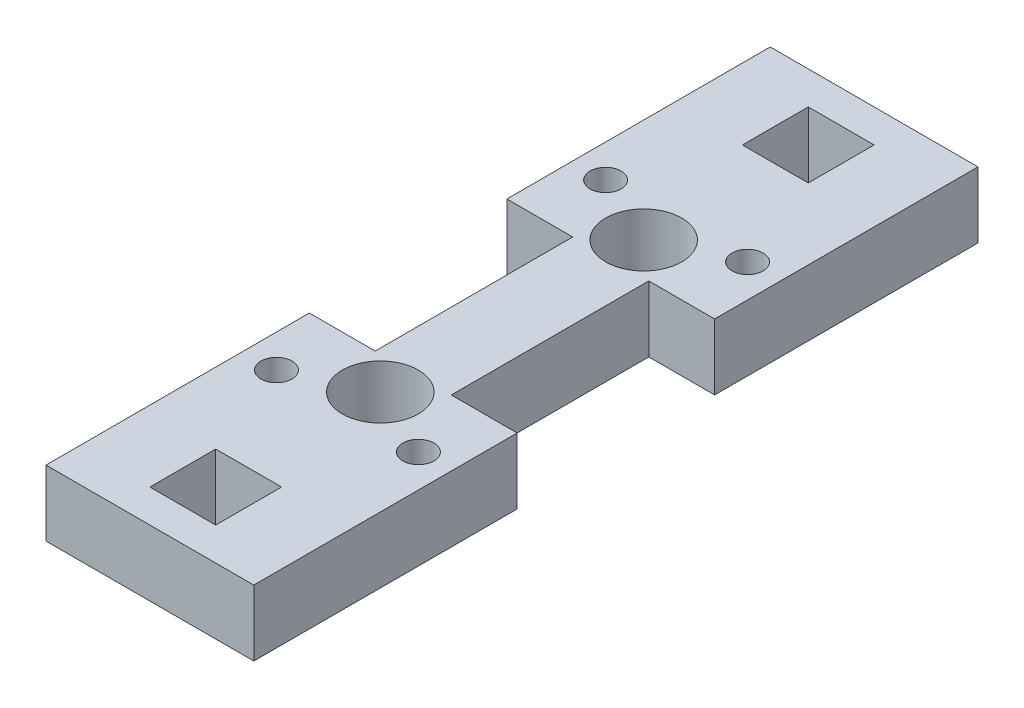
ISO-10303-21;
HEADER;
FILE_DESCRIPTION(('STEP AP214'),'2;1');
FILE_NAME('part.step','',(''),(''),'','','');
FILE_SCHEMA(('AUTOMOTIVE_DESIGN { 1 0 10303 214 1 1 1 1 }'));
ENDSEC;
DATA;
#1=APPLICATION_CONTEXT('core data for automotive mechanical design processes');
#2=APPLICATION_PROTOCOL_DEFINITION('international standard','automotive_design',2000,#1);
#3=PRODUCT_CONTEXT('',#1,'mechanical');
#4=PRODUCT('Part','Part','',(#3));
#5=PRODUCT_RELATED_PRODUCT_CATEGORY('part','',(#4));
#6=PRODUCT_DEFINITION_FORMATION('','',#4);
#7=PRODUCT_DEFINITION_CONTEXT('part definition',#1,'design');
#8=PRODUCT_DEFINITION('design','',#6,#7);
#9=PRODUCT_DEFINITION_SHAPE('','',#8);
#10=(LENGTH_UNIT() NAMED_UNIT(*) SI_UNIT(.MILLI.,.METRE.));
#11=(NAMED_UNIT(*) PLANE_ANGLE_UNIT() SI_UNIT($,.RADIAN.));
#12=(NAMED_UNIT(*) SI_UNIT($,.STERADIAN.) SOLID_ANGLE_UNIT());
#13=UNCERTAINTY_MEASURE_WITH_UNIT(LENGTH_MEASURE(1.E-05),#10,'distance_accuracy_value','');
#14=(GEOMETRIC_REPRESENTATION_CONTEXT(3) GLOBAL_UNCERTAINTY_ASSIGNED_CONTEXT((#13)) GLOBAL_UNIT_ASSIGNED_CONTEXT((#10,
#11,#12)) REPRESENTATION_CONTEXT('',''));
#15=CARTESIAN_POINT('',(0.,0.,0.));
#16=DIRECTION('',(0.,0.,1.));
#17=DIRECTION('',(1.,0.,0.));
#18=AXIS2_PLACEMENT_3D('',#15,#16,#17);
#19=CARTESIAN_POINT('',(0.,6.35,-44.45));
#20=DIRECTION('',(0.,0.,-1.));
#21=DIRECTION('',(-1.,0.,0.));
#22=AXIS2_PLACEMENT_3D('',#19,#20,#21);
#23=PLANE('',#22);
#24=DIRECTION('',(1.,0.,0.));
#25=VECTOR('',#24,1.);
#26=CARTESIAN_POINT('',(0.,0.,-44.45));
#27=LINE('',#26,#25);
#28=CARTESIAN_POINT('',(0.,0.,-44.45));
#29=VERTEX_POINT('',#28);
#30=CARTESIAN_POINT('',(6.35,0.,-44.45));
#31=VERTEX_POINT('',#30);
#32=EDGE_CURVE('E245',#29,#31,#27,.T.);
#33=ORIENTED_EDGE('',*,*,#32,.T.);
#34=DIRECTION('',(0.,-1.,0.));
#35=VECTOR('',#34,1.);
#36=CARTESIAN_POINT('',(6.35,6.35,-44.45));
#37=LINE('',#36,#35);
#38=CARTESIAN_POINT('',(6.35,6.35,-44.45));
#39=VERTEX_POINT('',#38);
#40=EDGE_CURVE('E11',#39,#31,#37,.T.);
#41=ORIENTED_EDGE('',*,*,#40,.F.);
#42=DIRECTION('',(1.,0.,0.));
#43=VECTOR('',#42,1.);
#44=CARTESIAN_POINT('',(0.,6.35,-44.45));
#45=LINE('',#44,#43);
#46=CARTESIAN_POINT('',(0.,6.35,-44.45));
#47=VERTEX_POINT('',#46);
#48=EDGE_CURVE('E553',#47,#39,#45,.T.);
#49=ORIENTED_EDGE('',*,*,#48,.F.);
#50=DIRECTION('',(0.,-1.,0.));
#51=VECTOR('',#50,1.);
#52=CARTESIAN_POINT('',(0.,6.35,-44.45));
#53=LINE('',#52,#51);
#54=EDGE_CURVE('E54',#47,#29,#53,.T.);
#55=ORIENTED_EDGE('',*,*,#54,.T.);
#56=EDGE_LOOP('',(#33,#41,#49,#55));
#57=FACE_BOUND('',#56,.T.);
#58=ADVANCED_FACE('F35',(#57),#23,.F.);
#59=CARTESIAN_POINT('',(6.35000000000002,6.35,0.));
#60=DIRECTION('',(1.,0.,0.));
#61=DIRECTION('',(0.,0.,-1.));
#62=AXIS2_PLACEMENT_3D('',#59,#60,#61);
#63=PLANE('',#62);
#64=DIRECTION('',(0.,0.,1.));
#65=VECTOR('',#64,1.);
#66=CARTESIAN_POINT('',(6.35000000000002,0.,0.));
#67=LINE('',#66,#65);
#68=CARTESIAN_POINT('',(6.35,0.,-25.4));
#69=VERTEX_POINT('',#68);
#70=EDGE_CURVE('E247',#31,#69,#67,.T.);
#71=ORIENTED_EDGE('',*,*,#70,.T.);
#72=DIRECTION('',(0.,-1.,0.));
#73=VECTOR('',#72,1.);
#74=CARTESIAN_POINT('',(6.35,6.35,-25.4));
#75=LINE('',#74,#73);
#76=CARTESIAN_POINT('',(6.35,6.35,-25.4));
#77=VERTEX_POINT('',#76);
#78=EDGE_CURVE('E45',#77,#69,#75,.T.);
#79=ORIENTED_EDGE('',*,*,#78,.F.);
#80=DIRECTION('',(0.,0.,1.));
#81=VECTOR('',#80,1.);
#82=CARTESIAN_POINT('',(6.35000000000002,6.35,0.));
#83=LINE('',#82,#81);
#84=EDGE_CURVE('E511',#39,#77,#83,.T.);
#85=ORIENTED_EDGE('',*,*,#84,.F.);
#86=ORIENTED_EDGE('',*,*,#40,.T.);
#87=EDGE_LOOP('',(#71,#79,#85,#86));
#88=FACE_BOUND('',#87,.T.);
#89=ADVANCED_FACE('F333',(#88),#63,.F.);
#90=CARTESIAN_POINT('',(0.,6.35,-25.4));
#91=DIRECTION('',(0.,0.,-1.));
#92=DIRECTION('',(-1.,0.,0.));
#93=AXIS2_PLACEMENT_3D('',#90,#91,#92);
#94=PLANE('',#93);
#95=DIRECTION('',(1.,0.,0.));
#96=VECTOR('',#95,1.);
#97=CARTESIAN_POINT('',(0.,0.,-25.4));
#98=LINE('',#97,#96);
#99=CARTESIAN_POINT('',(0.,0.,-25.4));
#100=VERTEX_POINT('',#99);
#101=EDGE_CURVE('E250',#100,#69,#98,.T.);
#102=ORIENTED_EDGE('',*,*,#101,.F.);
#103=DIRECTION('',(0.,-1.,0.));
#104=VECTOR('',#103,1.);
#105=CARTESIAN_POINT('',(0.,6.35,-25.4));
#106=LINE('',#105,#104);
#107=CARTESIAN_POINT('',(0.,6.35,-25.4));
#108=VERTEX_POINT('',#107);
#109=EDGE_CURVE('E287',#108,#100,#106,.T.);
#110=ORIENTED_EDGE('',*,*,#109,.F.);
#111=DIRECTION('',(1.,0.,0.));
#112=VECTOR('',#111,1.);
#113=CARTESIAN_POINT('',(0.,6.35,-25.4));
#114=LINE('',#113,#112);
#115=EDGE_CURVE('E509',#108,#77,#114,.T.);
#116=ORIENTED_EDGE('',*,*,#115,.T.);
#117=ORIENTED_EDGE('',*,*,#78,.T.);
#118=EDGE_LOOP('',(#102,#110,#116,#117));
#119=FACE_BOUND('',#118,.T.);
#120=ADVANCED_FACE('F338',(#119),#94,.T.);
#121=CARTESIAN_POINT('',(0.,6.35,0.));
#122=DIRECTION('',(-1.,0.,0.));
#123=DIRECTION('',(0.,0.,1.));
#124=AXIS2_PLACEMENT_3D('',#121,#122,#123);
#125=PLANE('',#124);
#126=DIRECTION('',(0.,0.,-1.));
#127=VECTOR('',#126,1.);
#128=CARTESIAN_POINT('',(0.,0.,0.));
#129=LINE('',#128,#127);
#130=CARTESIAN_POINT('',(0.,0.,0.));
#131=VERTEX_POINT('',#130);
#132=EDGE_CURVE('E253',#131,#100,#129,.T.);
#133=ORIENTED_EDGE('',*,*,#132,.F.);
#134=DIRECTION('',(0.,-1.,0.));
#135=VECTOR('',#134,1.);
#136=CARTESIAN_POINT('',(0.,6.35,0.));
#137=LINE('',#136,#135);
#138=CARTESIAN_POINT('',(0.,6.35,0.));
#139=VERTEX_POINT('',#138);
#140=EDGE_CURVE('E285',#139,#131,#137,.T.);
#141=ORIENTED_EDGE('',*,*,#140,.F.);
#142=DIRECTION('',(0.,0.,-1.));
#143=VECTOR('',#142,1.);
#144=CARTESIAN_POINT('',(0.,6.35,0.));
#145=LINE('',#144,#143);
#146=EDGE_CURVE('E210',#139,#108,#145,.T.);
#147=ORIENTED_EDGE('',*,*,#146,.T.);
#148=ORIENTED_EDGE('',*,*,#109,.T.);
#149=EDGE_LOOP('',(#133,#141,#147,#148));
#150=FACE_BOUND('',#149,.T.);
#151=ADVANCED_FACE('F411',(#150),#125,.T.);
#152=CARTESIAN_POINT('',(0.,6.35,0.));
#153=DIRECTION('',(0.,0.,-1.));
#154=DIRECTION('',(-1.,0.,0.));
#155=AXIS2_PLACEMENT_3D('',#152,#153,#154);
#156=PLANE('',#155);
#157=DIRECTION('',(1.,0.,0.));
#158=VECTOR('',#157,1.);
#159=CARTESIAN_POINT('',(0.,0.,0.));
#160=LINE('',#159,#158);
#161=CARTESIAN_POINT('',(20.0405999999999,0.,0.));
#162=VERTEX_POINT('',#161);
#163=EDGE_CURVE('E256',#131,#162,#160,.T.);
#164=ORIENTED_EDGE('',*,*,#163,.T.);
#165=DIRECTION('',(0.,-1.,0.));
#166=VECTOR('',#165,1.);
#167=CARTESIAN_POINT('',(20.0405999999999,6.35,0.));
#168=LINE('',#167,#166);
#169=CARTESIAN_POINT('',(20.0405999999999,6.35,0.));
#170=VERTEX_POINT('',#169);
#171=EDGE_CURVE('E282',#170,#162,#168,.T.);
#172=ORIENTED_EDGE('',*,*,#171,.F.);
#173=DIRECTION('',(1.,0.,0.));
#174=VECTOR('',#173,1.);
#175=CARTESIAN_POINT('',(0.,6.35,0.));
#176=LINE('',#175,#174);
#177=EDGE_CURVE('E508',#139,#170,#176,.T.);
#178=ORIENTED_EDGE('',*,*,#177,.F.);
#179=ORIENTED_EDGE('',*,*,#140,.T.);
#180=EDGE_LOOP('',(#164,#172,#178,#179));
#181=FACE_BOUND('',#180,.T.);
#182=ADVANCED_FACE('F488',(#181),#156,.F.);
#183=CARTESIAN_POINT('',(20.0405999999999,6.35,0.));
#184=DIRECTION('',(-1.,0.,0.));
#185=DIRECTION('',(0.,0.,1.));
#186=AXIS2_PLACEMENT_3D('',#183,#184,#185);
#187=PLANE('',#186);
#188=DIRECTION('',(0.,0.,-1.));
#189=VECTOR('',#188,1.);
#190=CARTESIAN_POINT('',(20.0405999999999,0.,0.));
#191=LINE('',#190,#189);
#192=CARTESIAN_POINT('',(20.0405999999999,0.,-25.4));
#193=VERTEX_POINT('',#192);
#194=EDGE_CURVE('E259',#162,#193,#191,.T.);
#195=ORIENTED_EDGE('',*,*,#194,.T.);
#196=DIRECTION('',(0.,-1.,0.));
#197=VECTOR('',#196,1.);
#198=CARTESIAN_POINT('',(20.0405999999999,6.35,-25.4));
#199=LINE('',#198,#197);
#200=CARTESIAN_POINT('',(20.0405999999999,6.35,-25.4));
#201=VERTEX_POINT('',#200);
#202=EDGE_CURVE('E280',#201,#193,#199,.T.);
#203=ORIENTED_EDGE('',*,*,#202,.F.);
#204=DIRECTION('',(0.,0.,-1.));
#205=VECTOR('',#204,1.);
#206=CARTESIAN_POINT('',(20.0405999999999,6.35,0.));
#207=LINE('',#206,#205);
#208=EDGE_CURVE('E195',#170,#201,#207,.T.);
#209=ORIENTED_EDGE('',*,*,#208,.F.);
#210=ORIENTED_EDGE('',*,*,#171,.T.);
#211=EDGE_LOOP('',(#195,#203,#209,#210));
#212=FACE_BOUND('',#211,.T.);
#213=ADVANCED_FACE('F476',(#212),#187,.F.);
#214=CARTESIAN_POINT('',(0.,6.35,-25.4));
#215=DIRECTION('',(0.,0.,-1.));
#216=DIRECTION('',(-1.,0.,0.));
#217=AXIS2_PLACEMENT_3D('',#214,#215,#216);
#218=PLANE('',#217);
#219=DIRECTION('',(1.,0.,0.));
#220=VECTOR('',#219,1.);
#221=CARTESIAN_POINT('',(0.,0.,-25.4));
#222=LINE('',#221,#220);
#223=CARTESIAN_POINT('',(13.6905999999999,0.,-25.4));
#224=VERTEX_POINT('',#223);
#225=EDGE_CURVE('E262',#224,#193,#222,.T.);
#226=ORIENTED_EDGE('',*,*,#225,.F.);
#227=DIRECTION('',(0.,-1.,0.));
#228=VECTOR('',#227,1.);
#229=CARTESIAN_POINT('',(13.6905999999999,6.35,-25.4));
#230=LINE('',#229,#228);
#231=CARTESIAN_POINT('',(13.6905999999999,6.35,-25.4));
#232=VERTEX_POINT('',#231);
#233=EDGE_CURVE('E278',#232,#224,#230,.T.);
#234=ORIENTED_EDGE('',*,*,#233,.F.);
#235=DIRECTION('',(1.,0.,0.));
#236=VECTOR('',#235,1.);
#237=CARTESIAN_POINT('',(0.,6.35,-25.4));
#238=LINE('',#237,#236);
#239=EDGE_CURVE('E515',#232,#201,#238,.T.);
#240=ORIENTED_EDGE('',*,*,#239,.T.);
#241=ORIENTED_EDGE('',*,*,#202,.T.);
#242=EDGE_LOOP('',(#226,#234,#240,#241));
#243=FACE_BOUND('',#242,.T.);
#244=ADVANCED_FACE('F483',(#243),#218,.T.);
#245=CARTESIAN_POINT('',(13.6905999999999,6.35,0.));
#246=DIRECTION('',(1.,0.,0.));
#247=DIRECTION('',(0.,0.,-1.));
#248=AXIS2_PLACEMENT_3D('',#245,#246,#247);
#249=PLANE('',#248);
#250=DIRECTION('',(0.,0.,1.));
#251=VECTOR('',#250,1.);
#252=CARTESIAN_POINT('',(13.6905999999999,0.,0.));
#253=LINE('',#252,#251);
#254=CARTESIAN_POINT('',(13.6905999999999,0.,-44.45));
#255=VERTEX_POINT('',#254);
#256=EDGE_CURVE('E265',#255,#224,#253,.T.);
#257=ORIENTED_EDGE('',*,*,#256,.F.);
#258=DIRECTION('',(0.,-1.,0.));
#259=VECTOR('',#258,1.);
#260=CARTESIAN_POINT('',(13.6905999999999,6.35,-44.45));
#261=LINE('',#260,#259);
#262=CARTESIAN_POINT('',(13.6905999999999,6.35,-44.45));
#263=VERTEX_POINT('',#262);
#264=EDGE_CURVE('E276',#263,#255,#261,.T.);
#265=ORIENTED_EDGE('',*,*,#264,.F.);
#266=DIRECTION('',(0.,0.,1.));
#267=VECTOR('',#266,1.);
#268=CARTESIAN_POINT('',(13.6905999999999,6.35,0.));
#269=LINE('',#268,#267);
#270=EDGE_CURVE('E517',#263,#232,#269,.T.);
#271=ORIENTED_EDGE('',*,*,#270,.T.);
#272=ORIENTED_EDGE('',*,*,#233,.T.);
#273=EDGE_LOOP('',(#257,#265,#271,#272));
#274=FACE_BOUND('',#273,.T.);
#275=ADVANCED_FACE('F479',(#274),#249,.T.);
#276=CARTESIAN_POINT('',(0.,6.35,-44.45));
#277=DIRECTION('',(0.,0.,-1.));
#278=DIRECTION('',(-1.,0.,0.));
#279=AXIS2_PLACEMENT_3D('',#276,#277,#278);
#280=PLANE('',#279);
#281=DIRECTION('',(1.,0.,0.));
#282=VECTOR('',#281,1.);
#283=CARTESIAN_POINT('',(0.,0.,-44.45));
#284=LINE('',#283,#282);
#285=CARTESIAN_POINT('',(20.0405999999999,0.,-44.45));
#286=VERTEX_POINT('',#285);
#287=EDGE_CURVE('E268',#255,#286,#284,.T.);
#288=ORIENTED_EDGE('',*,*,#287,.T.);
#289=DIRECTION('',(0.,-1.,0.));
#290=VECTOR('',#289,1.);
#291=CARTESIAN_POINT('',(20.0405999999999,6.35,-44.45));
#292=LINE('',#291,#290);
#293=CARTESIAN_POINT('',(20.0405999999999,6.35,-44.45));
#294=VERTEX_POINT('',#293);
#295=EDGE_CURVE('E203',#294,#286,#292,.T.);
#296=ORIENTED_EDGE('',*,*,#295,.F.);
#297=DIRECTION('',(1.,0.,0.));
#298=VECTOR('',#297,1.);
#299=CARTESIAN_POINT('',(0.,6.35,-44.45));
#300=LINE('',#299,#298);
#301=EDGE_CURVE('E190',#263,#294,#300,.T.);
#302=ORIENTED_EDGE('',*,*,#301,.F.);
#303=ORIENTED_EDGE('',*,*,#264,.T.);
#304=EDGE_LOOP('',(#288,#296,#302,#303));
#305=FACE_BOUND('',#304,.T.);
#306=ADVANCED_FACE('F475',(#305),#280,.F.);
#307=CARTESIAN_POINT('',(20.0405999999999,0.,-69.85));
#308=VERTEX_POINT('',#307);
#309=EDGE_CURVE('E200',#286,#308,#191,.T.);
#310=ORIENTED_EDGE('',*,*,#309,.T.);
#311=DIRECTION('',(0.,-1.,0.));
#312=VECTOR('',#311,1.);
#313=CARTESIAN_POINT('',(20.0405999999999,6.35,-69.85));
#314=LINE('',#313,#312);
#315=CARTESIAN_POINT('',(20.0405999999999,6.35,-69.85));
#316=VERTEX_POINT('',#315);
#317=EDGE_CURVE('E197',#316,#308,#314,.T.);
#318=ORIENTED_EDGE('',*,*,#317,.F.);
#319=EDGE_CURVE('E181',#294,#316,#207,.T.);
#320=ORIENTED_EDGE('',*,*,#319,.F.);
#321=ORIENTED_EDGE('',*,*,#295,.T.);
#322=EDGE_LOOP('',(#310,#318,#320,#321));
#323=FACE_BOUND('',#322,.T.);
#324=ADVANCED_FACE('F198',(#323),#187,.F.);
#325=CARTESIAN_POINT('',(0.,6.35,-69.85));
#326=DIRECTION('',(0.,0.,-1.));
#327=DIRECTION('',(-1.,0.,0.));
#328=AXIS2_PLACEMENT_3D('',#325,#326,#327);
#329=PLANE('',#328);
#330=DIRECTION('',(1.,0.,0.));
#331=VECTOR('',#330,1.);
#332=CARTESIAN_POINT('',(0.,0.,-69.85));
#333=LINE('',#332,#331);
#334=CARTESIAN_POINT('',(0.,0.,-69.85));
#335=VERTEX_POINT('',#334);
#336=EDGE_CURVE('E270',#335,#308,#333,.T.);
#337=ORIENTED_EDGE('',*,*,#336,.F.);
#338=DIRECTION('',(0.,-1.,0.));
#339=VECTOR('',#338,1.);
#340=CARTESIAN_POINT('',(0.,6.35,-69.85));
#341=LINE('',#340,#339);
#342=CARTESIAN_POINT('',(0.,6.35,-69.85));
#343=VERTEX_POINT('',#342);
#344=EDGE_CURVE('E116',#343,#335,#341,.T.);
#345=ORIENTED_EDGE('',*,*,#344,.F.);
#346=DIRECTION('',(1.,0.,0.));
#347=VECTOR('',#346,1.);
#348=CARTESIAN_POINT('',(0.,6.35,-69.85));
#349=LINE('',#348,#347);
#350=EDGE_CURVE('E187',#343,#316,#349,.T.);
#351=ORIENTED_EDGE('',*,*,#350,.T.);
#352=ORIENTED_EDGE('',*,*,#317,.T.);
#353=EDGE_LOOP('',(#337,#345,#351,#352));
#354=FACE_BOUND('',#353,.T.);
#355=ADVANCED_FACE('F205',(#354),#329,.T.);
#356=CARTESIAN_POINT('',(-1.45716771982052E-13,6.35,-66.675));
#357=DIRECTION('',(0.,0.,-1.));
#358=DIRECTION('',(-1.,0.,0.));
#359=AXIS2_PLACEMENT_3D('',#356,#357,#358);
#360=PLANE('',#359);
#361=DIRECTION('',(1.,0.,0.));
#362=VECTOR('',#361,1.);
#363=CARTESIAN_POINT('',(-1.45716771982052E-13,0.,-66.675));
#364=LINE('',#363,#362);
#365=CARTESIAN_POINT('',(6.84529999999994,0.,-66.675));
#366=VERTEX_POINT('',#365);
#367=CARTESIAN_POINT('',(13.1952999999999,0.,-66.675));
#368=VERTEX_POINT('',#367);
#369=EDGE_CURVE('E233',#366,#368,#364,.T.);
#370=ORIENTED_EDGE('',*,*,#369,.T.);
#371=DIRECTION('',(0.,-1.,0.));
#372=VECTOR('',#371,1.);
#373=CARTESIAN_POINT('',(13.1952999999999,6.35,-66.675));
#374=LINE('',#373,#372);
#375=CARTESIAN_POINT('',(13.1952999999999,6.35,-66.675));
#376=VERTEX_POINT('',#375);
#377=EDGE_CURVE('E273',#376,#368,#374,.T.);
#378=ORIENTED_EDGE('',*,*,#377,.F.);
#379=DIRECTION('',(1.,0.,0.));
#380=VECTOR('',#379,1.);
#381=CARTESIAN_POINT('',(-1.45716771982052E-13,6.35,-66.675));
#382=LINE('',#381,#380);
#383=CARTESIAN_POINT('',(6.84529999999994,6.35,-66.675));
#384=VERTEX_POINT('',#383);
#385=EDGE_CURVE('E542',#384,#376,#382,.T.);
#386=ORIENTED_EDGE('',*,*,#385,.F.);
#387=DIRECTION('',(0.,-1.,0.));
#388=VECTOR('',#387,1.);
#389=CARTESIAN_POINT('',(6.84529999999994,6.35,-66.675));
#390=LINE('',#389,#388);
#391=EDGE_CURVE('E290',#384,#366,#390,.T.);
#392=ORIENTED_EDGE('',*,*,#391,.T.);
#393=EDGE_LOOP('',(#370,#378,#386,#392));
#394=FACE_BOUND('',#393,.T.);
#395=ADVANCED_FACE('F350',(#394),#360,.F.);
#396=CARTESIAN_POINT('',(13.1953,6.35,0.));
#397=DIRECTION('',(1.,0.,0.));
#398=DIRECTION('',(0.,0.,-1.));
#399=AXIS2_PLACEMENT_3D('',#396,#397,#398);
#400=PLANE('',#399);
#401=DIRECTION('',(0.,0.,1.));
#402=VECTOR('',#401,1.);
#403=CARTESIAN_POINT('',(13.1953,0.,0.));
#404=LINE('',#403,#402);
#405=CARTESIAN_POINT('',(13.1952999999999,0.,-60.325));
#406=VERTEX_POINT('',#405);
#407=EDGE_CURVE('E236',#368,#406,#404,.T.);
#408=ORIENTED_EDGE('',*,*,#407,.T.);
#409=DIRECTION('',(0.,-1.,0.));
#410=VECTOR('',#409,1.);
#411=CARTESIAN_POINT('',(13.1952999999999,6.35,-60.325));
#412=LINE('',#411,#410);
#413=CARTESIAN_POINT('',(13.1952999999999,6.35,-60.325));
#414=VERTEX_POINT('',#413);
#415=EDGE_CURVE('E294',#414,#406,#412,.T.);
#416=ORIENTED_EDGE('',*,*,#415,.F.);
#417=DIRECTION('',(0.,0.,1.));
#418=VECTOR('',#417,1.);
#419=CARTESIAN_POINT('',(13.1953,6.35,0.));
#420=LINE('',#419,#418);
#421=EDGE_CURVE('E545',#376,#414,#420,.T.);
#422=ORIENTED_EDGE('',*,*,#421,.F.);
#423=ORIENTED_EDGE('',*,*,#377,.T.);
#424=EDGE_LOOP('',(#408,#416,#422,#423));
#425=FACE_BOUND('',#424,.T.);
#426=ADVANCED_FACE('F346',(#425),#400,.F.);
#427=CARTESIAN_POINT('',(0.,6.35,-60.325));
#428=DIRECTION('',(0.,0.,-1.));
#429=DIRECTION('',(-1.,0.,0.));
#430=AXIS2_PLACEMENT_3D('',#427,#428,#429);
#431=PLANE('',#430);
#432=DIRECTION('',(1.,0.,0.));
#433=VECTOR('',#432,1.);
#434=CARTESIAN_POINT('',(0.,0.,-60.325));
#435=LINE('',#434,#433);
#436=CARTESIAN_POINT('',(6.84529999999994,0.,-60.325));
#437=VERTEX_POINT('',#436);
#438=EDGE_CURVE('E239',#437,#406,#435,.T.);
#439=ORIENTED_EDGE('',*,*,#438,.F.);
#440=DIRECTION('',(0.,-1.,0.));
#441=VECTOR('',#440,1.);
#442=CARTESIAN_POINT('',(6.84529999999994,6.35,-60.325));
#443=LINE('',#442,#441);
#444=CARTESIAN_POINT('',(6.84529999999994,6.35,-60.325));
#445=VERTEX_POINT('',#444);
#446=EDGE_CURVE('E292',#445,#437,#443,.T.);
#447=ORIENTED_EDGE('',*,*,#446,.F.);
#448=DIRECTION('',(1.,0.,0.));
#449=VECTOR('',#448,1.);
#450=CARTESIAN_POINT('',(0.,6.35,-60.325));
#451=LINE('',#450,#449);
#452=EDGE_CURVE('E547',#445,#414,#451,.T.);
#453=ORIENTED_EDGE('',*,*,#452,.T.);
#454=ORIENTED_EDGE('',*,*,#415,.T.);
#455=EDGE_LOOP('',(#439,#447,#453,#454));
#456=FACE_BOUND('',#455,.T.);
#457=ADVANCED_FACE('F343',(#456),#431,.T.);
#458=CARTESIAN_POINT('',(0.,6.35,-3.17499999999999));
#459=DIRECTION('',(0.,0.,1.));
#460=DIRECTION('',(1.,0.,0.));
#461=AXIS2_PLACEMENT_3D('',#458,#459,#460);
#462=PLANE('',#461);
#463=DIRECTION('',(-1.,0.,0.));
#464=VECTOR('',#463,1.);
#465=CARTESIAN_POINT('',(0.,0.,-3.17499999999999));
#466=LINE('',#465,#464);
#467=CARTESIAN_POINT('',(13.1952999999999,0.,-3.17499999999999));
#468=VERTEX_POINT('',#467);
#469=CARTESIAN_POINT('',(6.84529999999995,0.,-3.17499999999999));
#470=VERTEX_POINT('',#469);
#471=EDGE_CURVE('E221',#468,#470,#466,.T.);
#472=ORIENTED_EDGE('',*,*,#471,.T.);
#473=DIRECTION('',(0.,-1.,0.));
#474=VECTOR('',#473,1.);
#475=CARTESIAN_POINT('',(6.84529999999995,6.35,-3.17499999999999));
#476=LINE('',#475,#474);
#477=CARTESIAN_POINT('',(6.84529999999995,6.35,-3.17499999999999));
#478=VERTEX_POINT('',#477);
#479=EDGE_CURVE('E39',#478,#470,#476,.T.);
#480=ORIENTED_EDGE('',*,*,#479,.F.);
#481=DIRECTION('',(-1.,0.,0.));
#482=VECTOR('',#481,1.);
#483=CARTESIAN_POINT('',(0.,6.35,-3.17499999999999));
#484=LINE('',#483,#482);
#485=CARTESIAN_POINT('',(13.1952999999999,6.35,-3.17499999999999));
#486=VERTEX_POINT('',#485);
#487=EDGE_CURVE('E531',#486,#478,#484,.T.);
#488=ORIENTED_EDGE('',*,*,#487,.F.);
#489=DIRECTION('',(0.,-1.,0.));
#490=VECTOR('',#489,1.);
#491=CARTESIAN_POINT('',(13.1952999999999,6.35,-3.17499999999999));
#492=LINE('',#491,#490);
#493=EDGE_CURVE('E208',#486,#468,#492,.T.);
#494=ORIENTED_EDGE('',*,*,#493,.T.);
#495=EDGE_LOOP('',(#472,#480,#488,#494));
#496=FACE_BOUND('',#495,.T.);
#497=ADVANCED_FACE('F309',(#496),#462,.F.);
#498=CARTESIAN_POINT('',(6.84529999999995,6.35,0.));
#499=DIRECTION('',(-1.,0.,0.));
#500=DIRECTION('',(0.,0.,1.));
#501=AXIS2_PLACEMENT_3D('',#498,#499,#500);
#502=PLANE('',#501);
#503=DIRECTION('',(0.,0.,-1.));
#504=VECTOR('',#503,1.);
#505=CARTESIAN_POINT('',(6.84529999999995,0.,0.));
#506=LINE('',#505,#504);
#507=CARTESIAN_POINT('',(6.84529999999995,0.,-9.525));
#508=VERTEX_POINT('',#507);
#509=EDGE_CURVE('E224',#470,#508,#506,.T.);
#510=ORIENTED_EDGE('',*,*,#509,.T.);
#511=DIRECTION('',(0.,-1.,0.));
#512=VECTOR('',#511,1.);
#513=CARTESIAN_POINT('',(6.84529999999995,6.35,-9.525));
#514=LINE('',#513,#512);
#515=CARTESIAN_POINT('',(6.84529999999995,6.35,-9.525));
#516=VERTEX_POINT('',#515);
#517=EDGE_CURVE('E300',#516,#508,#514,.T.);
#518=ORIENTED_EDGE('',*,*,#517,.F.);
#519=DIRECTION('',(0.,0.,-1.));
#520=VECTOR('',#519,1.);
#521=CARTESIAN_POINT('',(6.84529999999995,6.35,0.));
#522=LINE('',#521,#520);
#523=EDGE_CURVE('E129',#478,#516,#522,.T.);
#524=ORIENTED_EDGE('',*,*,#523,.F.);
#525=ORIENTED_EDGE('',*,*,#479,.T.);
#526=EDGE_LOOP('',(#510,#518,#524,#525));
#527=FACE_BOUND('',#526,.T.);
#528=ADVANCED_FACE('F305',(#527),#502,.F.);
#529=CARTESIAN_POINT('',(0.,6.35,-9.525));
#530=DIRECTION('',(0.,0.,1.));
#531=DIRECTION('',(1.,0.,0.));
#532=AXIS2_PLACEMENT_3D('',#529,#530,#531);
#533=PLANE('',#532);
#534=DIRECTION('',(-1.,0.,0.));
#535=VECTOR('',#534,1.);
#536=CARTESIAN_POINT('',(0.,0.,-9.525));
#537=LINE('',#536,#535);
#538=CARTESIAN_POINT('',(13.1952999999999,0.,-9.525));
#539=VERTEX_POINT('',#538);
#540=EDGE_CURVE('E227',#539,#508,#537,.T.);
#541=ORIENTED_EDGE('',*,*,#540,.F.);
#542=DIRECTION('',(0.,-1.,0.));
#543=VECTOR('',#542,1.);
#544=CARTESIAN_POINT('',(13.1952999999999,6.35,-9.525));
#545=LINE('',#544,#543);
#546=CARTESIAN_POINT('',(13.1952999999999,6.35,-9.525));
#547=VERTEX_POINT('',#546);
#548=EDGE_CURVE('E299',#547,#539,#545,.T.);
#549=ORIENTED_EDGE('',*,*,#548,.F.);
#550=DIRECTION('',(-1.,0.,0.));
#551=VECTOR('',#550,1.);
#552=CARTESIAN_POINT('',(0.,6.35,-9.525));
#553=LINE('',#552,#551);
#554=EDGE_CURVE('E539',#547,#516,#553,.T.);
#555=ORIENTED_EDGE('',*,*,#554,.T.);
#556=ORIENTED_EDGE('',*,*,#517,.T.);
#557=EDGE_LOOP('',(#541,#549,#555,#556));
#558=FACE_BOUND('',#557,.T.);
#559=ADVANCED_FACE('F320',(#558),#533,.T.);
#560=CARTESIAN_POINT('',(6.84530000000001,6.35,0.));
#561=DIRECTION('',(1.,0.,0.));
#562=DIRECTION('',(0.,0.,-1.));
#563=AXIS2_PLACEMENT_3D('',#560,#561,#562);
#564=PLANE('',#563);
#565=DIRECTION('',(0.,0.,1.));
#566=VECTOR('',#565,1.);
#567=CARTESIAN_POINT('',(6.84530000000001,0.,0.));
#568=LINE('',#567,#566);
#569=EDGE_CURVE('E242',#366,#437,#568,.T.);
#570=ORIENTED_EDGE('',*,*,#569,.F.);
#571=ORIENTED_EDGE('',*,*,#391,.F.);
#572=DIRECTION('',(0.,0.,1.));
#573=VECTOR('',#572,1.);
#574=CARTESIAN_POINT('',(6.84530000000001,6.35,0.));
#575=LINE('',#574,#573);
#576=EDGE_CURVE('E550',#384,#445,#575,.T.);
#577=ORIENTED_EDGE('',*,*,#576,.T.);
#578=ORIENTED_EDGE('',*,*,#446,.T.);
#579=EDGE_LOOP('',(#570,#571,#577,#578));
#580=FACE_BOUND('',#579,.T.);
#581=ADVANCED_FACE('F322',(#580),#564,.T.);
#582=CARTESIAN_POINT('',(13.1952999999999,6.35,0.));
#583=DIRECTION('',(-1.,0.,0.));
#584=DIRECTION('',(0.,0.,1.));
#585=AXIS2_PLACEMENT_3D('',#582,#583,#584);
#586=PLANE('',#585);
#587=DIRECTION('',(0.,0.,-1.));
#588=VECTOR('',#587,1.);
#589=CARTESIAN_POINT('',(13.1952999999999,0.,0.));
#590=LINE('',#589,#588);
#591=EDGE_CURVE('E230',#468,#539,#590,.T.);
#592=ORIENTED_EDGE('',*,*,#591,.F.);
#593=ORIENTED_EDGE('',*,*,#493,.F.);
#594=DIRECTION('',(0.,0.,-1.));
#595=VECTOR('',#594,1.);
#596=CARTESIAN_POINT('',(13.1952999999999,6.35,0.));
#597=LINE('',#596,#595);
#598=EDGE_CURVE('E318',#486,#547,#597,.T.);
#599=ORIENTED_EDGE('',*,*,#598,.T.);
#600=ORIENTED_EDGE('',*,*,#548,.T.);
#601=EDGE_LOOP('',(#592,#593,#599,#600));
#602=FACE_BOUND('',#601,.T.);
#603=ADVANCED_FACE('F315',(#602),#586,.T.);
#604=CARTESIAN_POINT('',(10.0202999999999,6.35,-47.625));
#605=DIRECTION('',(0.,-1.,0.));
#606=DIRECTION('',(0.,0.,-1.));
#607=AXIS2_PLACEMENT_3D('',#604,#605,#606);
#608=CYLINDRICAL_SURFACE('',#607,3.6703);
#609=CARTESIAN_POINT('',(10.0202999999999,6.35,-47.625));
#610=DIRECTION('',(0.,1.,0.));
#611=DIRECTION('',(0.,0.,1.));
#612=AXIS2_PLACEMENT_3D('',#609,#610,#611);
#613=CIRCLE('',#612,3.6703);
#614=CARTESIAN_POINT('',(10.0202999999999,6.35,-43.9547));
#615=VERTEX_POINT('',#614);
#616=EDGE_CURVE('E528',#615,#615,#613,.T.);
#617=ORIENTED_EDGE('',*,*,#616,.T.);
#618=EDGE_LOOP('',(#617));
#619=FACE_BOUND('',#618,.T.);
#620=CARTESIAN_POINT('',(10.0202999999999,0.,-47.625));
#621=DIRECTION('',(0.,1.,0.));
#622=DIRECTION('',(0.,0.,1.));
#623=AXIS2_PLACEMENT_3D('',#620,#621,#622);
#624=CIRCLE('',#623,3.6703);
#625=CARTESIAN_POINT('',(10.0202999999999,0.,-43.9547));
#626=VERTEX_POINT('',#625);
#627=EDGE_CURVE('E217',#626,#626,#624,.T.);
#628=ORIENTED_EDGE('',*,*,#627,.F.);
#629=EDGE_LOOP('',(#628));
#630=FACE_BOUND('',#629,.T.);
#631=ADVANCED_FACE('F355',(#619,#630),#608,.F.);
#632=CARTESIAN_POINT('',(10.0202999999999,6.35,-22.225));
#633=DIRECTION('',(0.,-1.,0.));
#634=DIRECTION('',(0.,0.,-1.));
#635=AXIS2_PLACEMENT_3D('',#632,#633,#634);
#636=CYLINDRICAL_SURFACE('',#635,3.6703);
#637=CARTESIAN_POINT('',(10.0202999999999,6.35,-22.225));
#638=DIRECTION('',(0.,1.,0.));
#639=DIRECTION('',(0.,0.,1.));
#640=AXIS2_PLACEMENT_3D('',#637,#638,#639);
#641=CIRCLE('',#640,3.6703);
#642=CARTESIAN_POINT('',(10.0202999999999,6.35,-18.5547));
#643=VERTEX_POINT('',#642);
#644=EDGE_CURVE('E526',#643,#643,#641,.T.);
#645=ORIENTED_EDGE('',*,*,#644,.T.);
#646=EDGE_LOOP('',(#645));
#647=FACE_BOUND('',#646,.T.);
#648=CARTESIAN_POINT('',(10.0202999999999,0.,-22.225));
#649=DIRECTION('',(0.,1.,0.));
#650=DIRECTION('',(0.,0.,1.));
#651=AXIS2_PLACEMENT_3D('',#648,#649,#650);
#652=CIRCLE('',#651,3.6703);
#653=CARTESIAN_POINT('',(10.0202999999999,0.,-18.5547));
#654=VERTEX_POINT('',#653);
#655=EDGE_CURVE('E214',#654,#654,#652,.T.);
#656=ORIENTED_EDGE('',*,*,#655,.F.);
#657=EDGE_LOOP('',(#656));
#658=FACE_BOUND('',#657,.T.);
#659=ADVANCED_FACE('F37',(#647,#658),#636,.F.);
#660=EDGE_CURVE('E257',#29,#335,#129,.T.);
#661=ORIENTED_EDGE('',*,*,#660,.F.);
#662=ORIENTED_EDGE('',*,*,#54,.F.);
#663=EDGE_CURVE('E206',#47,#343,#145,.T.);
#664=ORIENTED_EDGE('',*,*,#663,.T.);
#665=ORIENTED_EDGE('',*,*,#344,.T.);
#666=EDGE_LOOP('',(#661,#662,#664,#665));
#667=FACE_BOUND('',#666,.T.);
#668=ADVANCED_FACE('F363',(#667),#125,.T.);
#669=CARTESIAN_POINT('',(0.,6.35,0.));
#670=DIRECTION('',(0.,1.,0.));
#671=DIRECTION('',(0.,0.,1.));
#672=AXIS2_PLACEMENT_3D('',#669,#670,#671);
#673=PLANE('',#672);
#674=CARTESIAN_POINT('',(16.8655999999999,6.35,-50.8));
#675=DIRECTION('',(0.,1.,0.));
#676=DIRECTION('',(0.,0.,-1.));
#677=AXIS2_PLACEMENT_3D('',#674,#675,#676);
#678=CIRCLE('',#677,1.5);
#679=CARTESIAN_POINT('',(16.8655999999999,6.35,-52.3));
#680=VERTEX_POINT('',#679);
#681=EDGE_CURVE('E581',#680,#680,#678,.T.);
#682=ORIENTED_EDGE('',*,*,#681,.F.);
#683=EDGE_LOOP('',(#682));
#684=FACE_BOUND('',#683,.T.);
#685=CARTESIAN_POINT('',(16.8655999999999,6.35,-19.05));
#686=DIRECTION('',(0.,1.,0.));
#687=DIRECTION('',(0.,0.,1.));
#688=AXIS2_PLACEMENT_3D('',#685,#686,#687);
#689=CIRCLE('',#688,1.5);
#690=CARTESIAN_POINT('',(16.8655999999999,6.35,-17.55));
#691=VERTEX_POINT('',#690);
#692=EDGE_CURVE('E575',#691,#691,#689,.T.);
#693=ORIENTED_EDGE('',*,*,#692,.F.);
#694=EDGE_LOOP('',(#693));
#695=FACE_BOUND('',#694,.T.);
#696=CARTESIAN_POINT('',(3.175,6.35,-19.05));
#697=DIRECTION('',(0.,1.,0.));
#698=DIRECTION('',(0.,0.,-1.));
#699=AXIS2_PLACEMENT_3D('',#696,#697,#698);
#700=CIRCLE('',#699,1.5);
#701=CARTESIAN_POINT('',(3.175,6.35,-20.55));
#702=VERTEX_POINT('',#701);
#703=EDGE_CURVE('E569',#702,#702,#700,.T.);
#704=ORIENTED_EDGE('',*,*,#703,.F.);
#705=EDGE_LOOP('',(#704));
#706=FACE_BOUND('',#705,.T.);
#707=CARTESIAN_POINT('',(3.175,6.35,-50.8));
#708=DIRECTION('',(0.,1.,0.));
#709=DIRECTION('',(0.,0.,1.));
#710=AXIS2_PLACEMENT_3D('',#707,#708,#709);
#711=CIRCLE('',#710,1.5);
#712=CARTESIAN_POINT('',(3.175,6.35,-49.3));
#713=VERTEX_POINT('',#712);
#714=EDGE_CURVE('E534',#713,#713,#711,.T.);
#715=ORIENTED_EDGE('',*,*,#714,.F.);
#716=EDGE_LOOP('',(#715));
#717=FACE_BOUND('',#716,.T.);
#718=ORIENTED_EDGE('',*,*,#644,.F.);
#719=EDGE_LOOP('',(#718));
#720=FACE_BOUND('',#719,.T.);
#721=ORIENTED_EDGE('',*,*,#616,.F.);
#722=EDGE_LOOP('',(#721));
#723=FACE_BOUND('',#722,.T.);
#724=ORIENTED_EDGE('',*,*,#487,.T.);
#725=ORIENTED_EDGE('',*,*,#523,.T.);
#726=ORIENTED_EDGE('',*,*,#554,.F.);
#727=ORIENTED_EDGE('',*,*,#598,.F.);
#728=EDGE_LOOP('',(#724,#725,#726,#727));
#729=FACE_BOUND('',#728,.T.);
#730=ORIENTED_EDGE('',*,*,#385,.T.);
#731=ORIENTED_EDGE('',*,*,#421,.T.);
#732=ORIENTED_EDGE('',*,*,#452,.F.);
#733=ORIENTED_EDGE('',*,*,#576,.F.);
#734=EDGE_LOOP('',(#730,#731,#732,#733));
#735=FACE_BOUND('',#734,.T.);
#736=ORIENTED_EDGE('',*,*,#48,.T.);
#737=ORIENTED_EDGE('',*,*,#84,.T.);
#738=ORIENTED_EDGE('',*,*,#115,.F.);
#739=ORIENTED_EDGE('',*,*,#146,.F.);
#740=ORIENTED_EDGE('',*,*,#177,.T.);
#741=ORIENTED_EDGE('',*,*,#208,.T.);
#742=ORIENTED_EDGE('',*,*,#239,.F.);
#743=ORIENTED_EDGE('',*,*,#270,.F.);
#744=ORIENTED_EDGE('',*,*,#301,.T.);
#745=ORIENTED_EDGE('',*,*,#319,.T.);
#746=ORIENTED_EDGE('',*,*,#350,.F.);
#747=ORIENTED_EDGE('',*,*,#663,.F.);
#748=EDGE_LOOP('',(#736,#737,#738,#739,#740,#741,#742,#743,#744,#745,#746,#747));
#749=FACE_BOUND('',#748,.T.);
#750=ADVANCED_FACE('F184',(#684,#695,#706,#717,#720,#723,#729,#735,#749),#673,.T.);
#751=CARTESIAN_POINT('',(0.,0.,0.));
#752=DIRECTION('',(0.,1.,0.));
#753=DIRECTION('',(0.,0.,1.));
#754=AXIS2_PLACEMENT_3D('',#751,#752,#753);
#755=PLANE('',#754);
#756=CARTESIAN_POINT('',(16.8655999999999,0.,-50.8));
#757=DIRECTION('',(0.,1.,0.));
#758=DIRECTION('',(0.,0.,-1.));
#759=AXIS2_PLACEMENT_3D('',#756,#757,#758);
#760=CIRCLE('',#759,1.5);
#761=CARTESIAN_POINT('',(16.8655999999999,0.,-52.3));
#762=VERTEX_POINT('',#761);
#763=EDGE_CURVE('E578',#762,#762,#760,.T.);
#764=ORIENTED_EDGE('',*,*,#763,.T.);
#765=EDGE_LOOP('',(#764));
#766=FACE_BOUND('',#765,.T.);
#767=CARTESIAN_POINT('',(16.8655999999999,0.,-19.05));
#768=DIRECTION('',(0.,1.,0.));
#769=DIRECTION('',(0.,0.,1.));
#770=AXIS2_PLACEMENT_3D('',#767,#768,#769);
#771=CIRCLE('',#770,1.5);
#772=CARTESIAN_POINT('',(16.8655999999999,0.,-17.55));
#773=VERTEX_POINT('',#772);
#774=EDGE_CURVE('E572',#773,#773,#771,.T.);
#775=ORIENTED_EDGE('',*,*,#774,.T.);
#776=EDGE_LOOP('',(#775));
#777=FACE_BOUND('',#776,.T.);
#778=CARTESIAN_POINT('',(3.175,0.,-19.05));
#779=DIRECTION('',(0.,1.,0.));
#780=DIRECTION('',(0.,0.,-1.));
#781=AXIS2_PLACEMENT_3D('',#778,#779,#780);
#782=CIRCLE('',#781,1.5);
#783=CARTESIAN_POINT('',(3.175,0.,-20.55));
#784=VERTEX_POINT('',#783);
#785=EDGE_CURVE('E566',#784,#784,#782,.T.);
#786=ORIENTED_EDGE('',*,*,#785,.T.);
#787=EDGE_LOOP('',(#786));
#788=FACE_BOUND('',#787,.T.);
#789=CARTESIAN_POINT('',(3.175,0.,-50.8));
#790=DIRECTION('',(0.,1.,0.));
#791=DIRECTION('',(0.,0.,1.));
#792=AXIS2_PLACEMENT_3D('',#789,#790,#791);
#793=CIRCLE('',#792,1.5);
#794=CARTESIAN_POINT('',(3.175,0.,-49.3));
#795=VERTEX_POINT('',#794);
#796=EDGE_CURVE('E218',#795,#795,#793,.T.);
#797=ORIENTED_EDGE('',*,*,#796,.T.);
#798=EDGE_LOOP('',(#797));
#799=FACE_BOUND('',#798,.T.);
#800=ORIENTED_EDGE('',*,*,#655,.T.);
#801=EDGE_LOOP('',(#800));
#802=FACE_BOUND('',#801,.T.);
#803=ORIENTED_EDGE('',*,*,#627,.T.);
#804=EDGE_LOOP('',(#803));
#805=FACE_BOUND('',#804,.T.);
#806=ORIENTED_EDGE('',*,*,#471,.F.);
#807=ORIENTED_EDGE('',*,*,#591,.T.);
#808=ORIENTED_EDGE('',*,*,#540,.T.);
#809=ORIENTED_EDGE('',*,*,#509,.F.);
#810=EDGE_LOOP('',(#806,#807,#808,#809));
#811=FACE_BOUND('',#810,.T.);
#812=ORIENTED_EDGE('',*,*,#369,.F.);
#813=ORIENTED_EDGE('',*,*,#569,.T.);
#814=ORIENTED_EDGE('',*,*,#438,.T.);
#815=ORIENTED_EDGE('',*,*,#407,.F.);
#816=EDGE_LOOP('',(#812,#813,#814,#815));
#817=FACE_BOUND('',#816,.T.);
#818=ORIENTED_EDGE('',*,*,#32,.F.);
#819=ORIENTED_EDGE('',*,*,#660,.T.);
#820=ORIENTED_EDGE('',*,*,#336,.T.);
#821=ORIENTED_EDGE('',*,*,#309,.F.);
#822=ORIENTED_EDGE('',*,*,#287,.F.);
#823=ORIENTED_EDGE('',*,*,#256,.T.);
#824=ORIENTED_EDGE('',*,*,#225,.T.);
#825=ORIENTED_EDGE('',*,*,#194,.F.);
#826=ORIENTED_EDGE('',*,*,#163,.F.);
#827=ORIENTED_EDGE('',*,*,#132,.T.);
#828=ORIENTED_EDGE('',*,*,#101,.T.);
#829=ORIENTED_EDGE('',*,*,#70,.F.);
#830=EDGE_LOOP('',(#818,#819,#820,#821,#822,#823,#824,#825,#826,#827,#828,#829));
#831=FACE_BOUND('',#830,.T.);
#832=ADVANCED_FACE('F312',(#766,#777,#788,#799,#802,#805,#811,#817,#831),#755,.F.);
#833=CARTESIAN_POINT('',(3.175,0.,-50.8));
#834=DIRECTION('',(0.,1.,0.));
#835=DIRECTION('',(0.,0.,1.));
#836=AXIS2_PLACEMENT_3D('',#833,#834,#835);
#837=CYLINDRICAL_SURFACE('',#836,1.5);
#838=ORIENTED_EDGE('',*,*,#796,.F.);
#839=EDGE_LOOP('',(#838));
#840=FACE_BOUND('',#839,.T.);
#841=ORIENTED_EDGE('',*,*,#714,.T.);
#842=EDGE_LOOP('',(#841));
#843=FACE_BOUND('',#842,.T.);
#844=ADVANCED_FACE('F425',(#840,#843),#837,.F.);
#845=CARTESIAN_POINT('',(3.175,0.,-19.05));
#846=DIRECTION('',(0.,1.,0.));
#847=DIRECTION('',(0.,0.,1.));
#848=AXIS2_PLACEMENT_3D('',#845,#846,#847);
#849=CYLINDRICAL_SURFACE('',#848,1.5);
#850=ORIENTED_EDGE('',*,*,#785,.F.);
#851=EDGE_LOOP('',(#850));
#852=FACE_BOUND('',#851,.T.);
#853=ORIENTED_EDGE('',*,*,#703,.T.);
#854=EDGE_LOOP('',(#853));
#855=FACE_BOUND('',#854,.T.);
#856=ADVANCED_FACE('F434',(#852,#855),#849,.F.);
#857=CARTESIAN_POINT('',(16.8655999999999,0.,-19.05));
#858=DIRECTION('',(0.,1.,0.));
#859=DIRECTION('',(0.,0.,1.));
#860=AXIS2_PLACEMENT_3D('',#857,#858,#859);
#861=CYLINDRICAL_SURFACE('',#860,1.5);
#862=ORIENTED_EDGE('',*,*,#774,.F.);
#863=EDGE_LOOP('',(#862));
#864=FACE_BOUND('',#863,.T.);
#865=ORIENTED_EDGE('',*,*,#692,.T.);
#866=EDGE_LOOP('',(#865));
#867=FACE_BOUND('',#866,.T.);
#868=ADVANCED_FACE('F444',(#864,#867),#861,.F.);
#869=CARTESIAN_POINT('',(16.8655999999999,0.,-50.8));
#870=DIRECTION('',(0.,1.,0.));
#871=DIRECTION('',(0.,0.,1.));
#872=AXIS2_PLACEMENT_3D('',#869,#870,#871);
#873=CYLINDRICAL_SURFACE('',#872,1.5);
#874=ORIENTED_EDGE('',*,*,#763,.F.);
#875=EDGE_LOOP('',(#874));
#876=FACE_BOUND('',#875,.T.);
#877=ORIENTED_EDGE('',*,*,#681,.T.);
#878=EDGE_LOOP('',(#877));
#879=FACE_BOUND('',#878,.T.);
#880=ADVANCED_FACE('F454',(#876,#879),#873,.F.);
#881=CLOSED_SHELL('',(#58,#89,#120,#151,#182,#213,#244,#275,#306,#324,#355,#395,#426,#457,#497,
#528,#559,#581,#603,#631,#659,#668,#750,#832,#844,#856,#868,#880));
#882=MANIFOLD_SOLID_BREP('B2',#881);
#883=ADVANCED_BREP_SHAPE_REPRESENTATION('',(#18,#882),#14);
#884=SHAPE_DEFINITION_REPRESENTATION(#9,#883);
ENDSEC;
END-ISO-10303-21;
